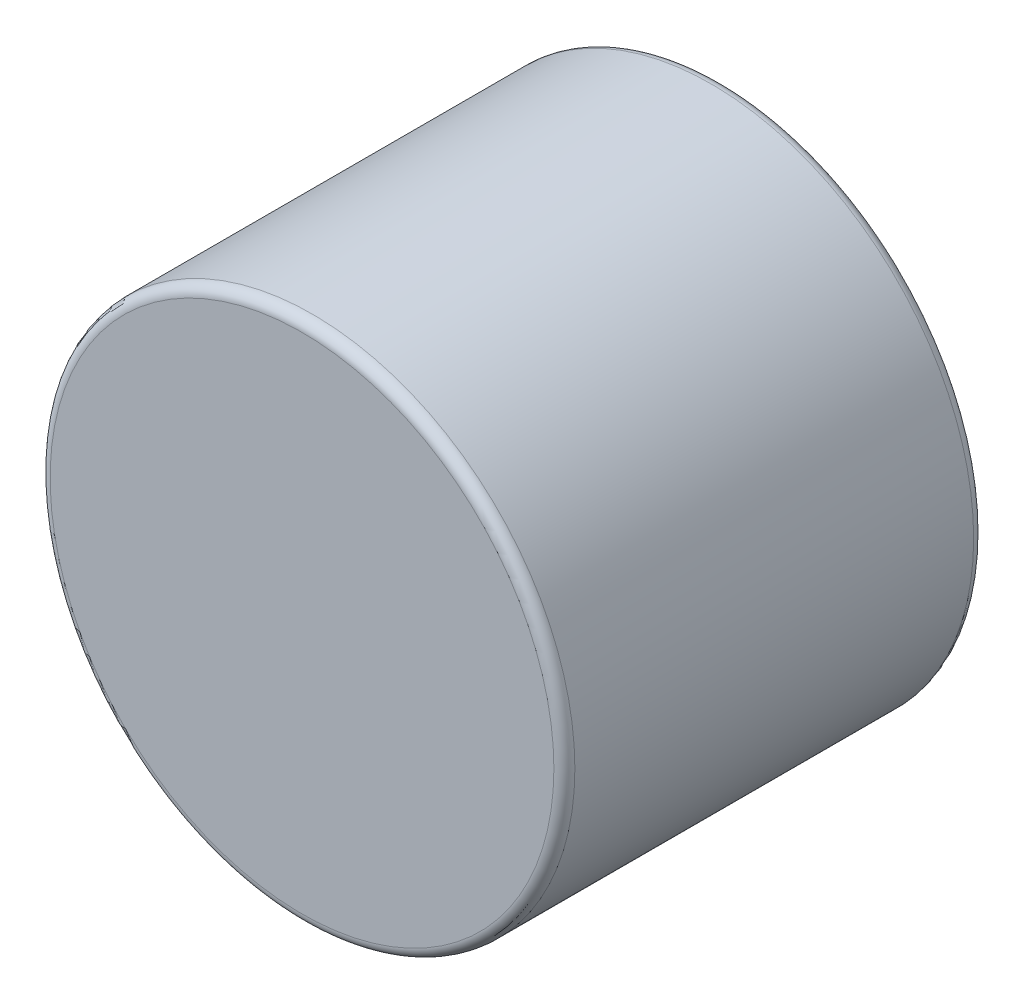
ISO-10303-21;
HEADER;
FILE_DESCRIPTION(('STEP AP214'),'2;1');
FILE_NAME('part.step','',(''),(''),'','','');
FILE_SCHEMA(('AUTOMOTIVE_DESIGN { 1 0 10303 214 1 1 1 1 }'));
ENDSEC;
DATA;
#1=APPLICATION_CONTEXT('core data for automotive mechanical design processes');
#2=APPLICATION_PROTOCOL_DEFINITION('international standard','automotive_design',2000,#1);
#3=PRODUCT_CONTEXT('',#1,'mechanical');
#4=PRODUCT('Part','Part','',(#3));
#5=PRODUCT_RELATED_PRODUCT_CATEGORY('part','',(#4));
#6=PRODUCT_DEFINITION_FORMATION('','',#4);
#7=PRODUCT_DEFINITION_CONTEXT('part definition',#1,'design');
#8=PRODUCT_DEFINITION('design','',#6,#7);
#9=PRODUCT_DEFINITION_SHAPE('','',#8);
#10=(LENGTH_UNIT() NAMED_UNIT(*) SI_UNIT(.MILLI.,.METRE.));
#11=(NAMED_UNIT(*) PLANE_ANGLE_UNIT() SI_UNIT($,.RADIAN.));
#12=(NAMED_UNIT(*) SI_UNIT($,.STERADIAN.) SOLID_ANGLE_UNIT());
#13=UNCERTAINTY_MEASURE_WITH_UNIT(LENGTH_MEASURE(1.E-05),#10,'distance_accuracy_value','');
#14=(GEOMETRIC_REPRESENTATION_CONTEXT(3) GLOBAL_UNCERTAINTY_ASSIGNED_CONTEXT((#13)) GLOBAL_UNIT_ASSIGNED_CONTEXT((#10,
#11,#12)) REPRESENTATION_CONTEXT('',''));
#15=CARTESIAN_POINT('',(0.,0.,0.));
#16=DIRECTION('',(0.,0.,1.));
#17=DIRECTION('',(1.,0.,0.));
#18=AXIS2_PLACEMENT_3D('',#15,#16,#17);
#19=CARTESIAN_POINT('',(0.,0.,3.175));
#20=DIRECTION('',(0.,0.,-1.));
#21=DIRECTION('',(-1.,0.,0.));
#22=AXIS2_PLACEMENT_3D('',#19,#20,#21);
#23=CYLINDRICAL_SURFACE('',#22,3.96875);
#24=CARTESIAN_POINT('',(0.,0.,-3.01625));
#25=DIRECTION('',(0.,0.,1.));
#26=DIRECTION('',(1.,0.,0.));
#27=AXIS2_PLACEMENT_3D('',#24,#25,#26);
#28=CIRCLE('',#27,3.96875);
#29=CARTESIAN_POINT('',(3.96875,0.,-3.01625));
#30=VERTEX_POINT('',#29);
#31=EDGE_CURVE('E46',#30,#30,#28,.T.);
#32=ORIENTED_EDGE('',*,*,#31,.T.);
#33=EDGE_LOOP('',(#32));
#34=FACE_BOUND('',#33,.T.);
#35=CARTESIAN_POINT('',(0.,0.,3.01625));
#36=DIRECTION('',(0.,0.,1.));
#37=DIRECTION('',(1.,0.,0.));
#38=AXIS2_PLACEMENT_3D('',#35,#36,#37);
#39=CIRCLE('',#38,3.96875);
#40=CARTESIAN_POINT('',(3.96875,0.,3.01625));
#41=VERTEX_POINT('',#40);
#42=EDGE_CURVE('E50',#41,#41,#39,.F.);
#43=ORIENTED_EDGE('',*,*,#42,.T.);
#44=EDGE_LOOP('',(#43));
#45=FACE_BOUND('',#44,.T.);
#46=ADVANCED_FACE('F35',(#34,#45),#23,.T.);
#47=CARTESIAN_POINT('',(0.,0.,3.175));
#48=DIRECTION('',(0.,0.,1.));
#49=DIRECTION('',(1.,0.,0.));
#50=AXIS2_PLACEMENT_3D('',#47,#48,#49);
#51=PLANE('',#50);
#52=CARTESIAN_POINT('',(0.,0.,3.175));
#53=DIRECTION('',(0.,0.,1.));
#54=DIRECTION('',(1.,0.,0.));
#55=AXIS2_PLACEMENT_3D('',#52,#53,#54);
#56=CIRCLE('',#55,3.81);
#57=CARTESIAN_POINT('',(3.81,0.,3.175));
#58=VERTEX_POINT('',#57);
#59=EDGE_CURVE('E10',#58,#58,#56,.T.);
#60=ORIENTED_EDGE('',*,*,#59,.T.);
#61=EDGE_LOOP('',(#60));
#62=FACE_BOUND('',#61,.T.);
#63=ADVANCED_FACE('F66',(#62),#51,.T.);
#64=CARTESIAN_POINT('',(0.,0.,-3.175));
#65=DIRECTION('',(0.,0.,1.));
#66=DIRECTION('',(1.,0.,0.));
#67=AXIS2_PLACEMENT_3D('',#64,#65,#66);
#68=PLANE('',#67);
#69=CARTESIAN_POINT('',(0.,0.,-3.175));
#70=DIRECTION('',(0.,0.,1.));
#71=DIRECTION('',(1.,0.,0.));
#72=AXIS2_PLACEMENT_3D('',#69,#70,#71);
#73=CIRCLE('',#72,3.81);
#74=CARTESIAN_POINT('',(3.81,0.,-3.175));
#75=VERTEX_POINT('',#74);
#76=EDGE_CURVE('E42',#75,#75,#73,.F.);
#77=ORIENTED_EDGE('',*,*,#76,.T.);
#78=EDGE_LOOP('',(#77));
#79=FACE_BOUND('',#78,.T.);
#80=ADVANCED_FACE('F63',(#79),#68,.F.);
#81=CARTESIAN_POINT('',(0.,0.,-3.01625));
#82=DIRECTION('',(0.,0.,1.));
#83=DIRECTION('',(1.,0.,0.));
#84=AXIS2_PLACEMENT_3D('',#81,#82,#83);
#85=TOROIDAL_SURFACE('',#84,3.81,0.15875);
#86=ORIENTED_EDGE('',*,*,#76,.F.);
#87=EDGE_LOOP('',(#86));
#88=FACE_BOUND('',#87,.T.);
#89=ORIENTED_EDGE('',*,*,#31,.F.);
#90=EDGE_LOOP('',(#89));
#91=FACE_BOUND('',#90,.T.);
#92=ADVANCED_FACE('F59',(#88,#91),#85,.T.);
#93=CARTESIAN_POINT('',(0.,0.,3.01625));
#94=DIRECTION('',(0.,0.,1.));
#95=DIRECTION('',(1.,0.,0.));
#96=AXIS2_PLACEMENT_3D('',#93,#94,#95);
#97=TOROIDAL_SURFACE('',#96,3.81,0.15875);
#98=ORIENTED_EDGE('',*,*,#42,.F.);
#99=EDGE_LOOP('',(#98));
#100=FACE_BOUND('',#99,.T.);
#101=ORIENTED_EDGE('',*,*,#59,.F.);
#102=EDGE_LOOP('',(#101));
#103=FACE_BOUND('',#102,.T.);
#104=ADVANCED_FACE('F37',(#100,#103),#97,.T.);
#105=CLOSED_SHELL('',(#46,#63,#80,#92,#104));
#106=MANIFOLD_SOLID_BREP('B2',#105);
#107=ADVANCED_BREP_SHAPE_REPRESENTATION('',(#18,#106),#14);
#108=SHAPE_DEFINITION_REPRESENTATION(#9,#107);
ENDSEC;
END-ISO-10303-21;
